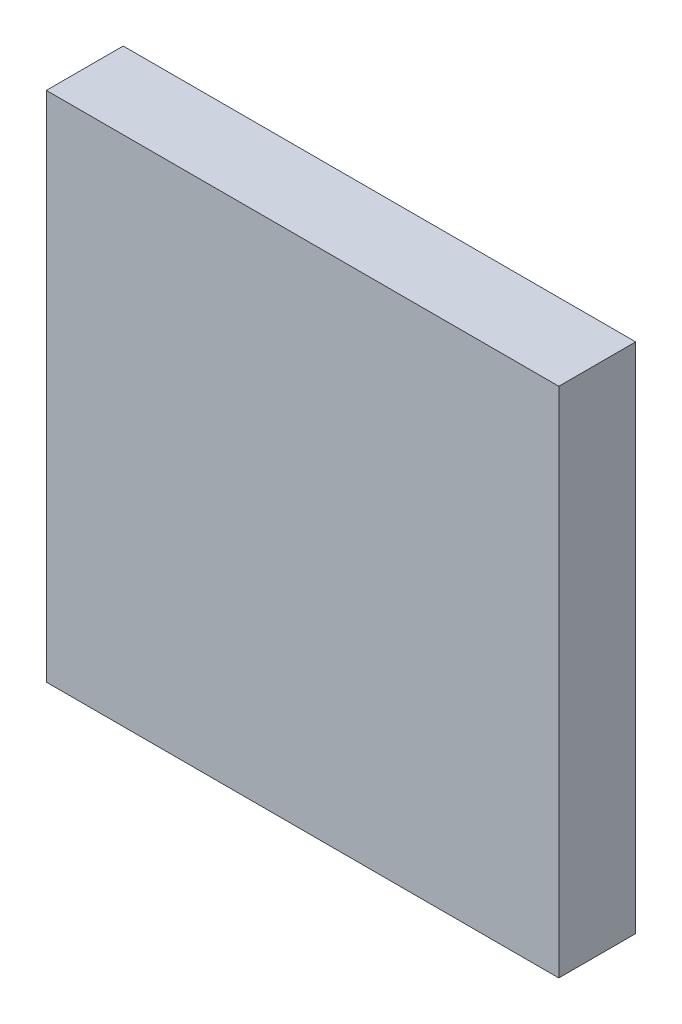
ISO-10303-21;
HEADER;
FILE_DESCRIPTION(('STEP AP214'),'2;1');
FILE_NAME('part.step','',(''),(''),'','','');
FILE_SCHEMA(('AUTOMOTIVE_DESIGN { 1 0 10303 214 1 1 1 1 }'));
ENDSEC;
DATA;
#1=APPLICATION_CONTEXT('core data for automotive mechanical design processes');
#2=APPLICATION_PROTOCOL_DEFINITION('international standard','automotive_design',2000,#1);
#3=PRODUCT_CONTEXT('',#1,'mechanical');
#4=PRODUCT('Part','Part','',(#3));
#5=PRODUCT_RELATED_PRODUCT_CATEGORY('part','',(#4));
#6=PRODUCT_DEFINITION_FORMATION('','',#4);
#7=PRODUCT_DEFINITION_CONTEXT('part definition',#1,'design');
#8=PRODUCT_DEFINITION('design','',#6,#7);
#9=PRODUCT_DEFINITION_SHAPE('','',#8);
#10=(LENGTH_UNIT() NAMED_UNIT(*) SI_UNIT(.MILLI.,.METRE.));
#11=(NAMED_UNIT(*) PLANE_ANGLE_UNIT() SI_UNIT($,.RADIAN.));
#12=(NAMED_UNIT(*) SI_UNIT($,.STERADIAN.) SOLID_ANGLE_UNIT());
#13=UNCERTAINTY_MEASURE_WITH_UNIT(LENGTH_MEASURE(1.E-05),#10,'distance_accuracy_value','');
#14=(GEOMETRIC_REPRESENTATION_CONTEXT(3) GLOBAL_UNCERTAINTY_ASSIGNED_CONTEXT((#13)) GLOBAL_UNIT_ASSIGNED_CONTEXT((#10,
#11,#12)) REPRESENTATION_CONTEXT('',''));
#15=CARTESIAN_POINT('',(0.,0.,0.));
#16=DIRECTION('',(0.,0.,1.));
#17=DIRECTION('',(1.,0.,0.));
#18=AXIS2_PLACEMENT_3D('',#15,#16,#17);
#19=CARTESIAN_POINT('',(0.,0.,30.));
#20=DIRECTION('',(0.,0.,-1.));
#21=DIRECTION('',(-1.,0.,0.));
#22=AXIS2_PLACEMENT_3D('',#19,#20,#21);
#23=PLANE('',#22);
#24=DIRECTION('',(0.,-1.,0.));
#25=VECTOR('',#24,1.);
#26=CARTESIAN_POINT('',(0.,0.,30.));
#27=LINE('',#26,#25);
#28=CARTESIAN_POINT('',(0.,200.,30.));
#29=VERTEX_POINT('',#28);
#30=CARTESIAN_POINT('',(0.,0.,30.));
#31=VERTEX_POINT('',#30);
#32=EDGE_CURVE('E86',#29,#31,#27,.T.);
#33=ORIENTED_EDGE('',*,*,#32,.T.);
#34=DIRECTION('',(1.,0.,0.));
#35=VECTOR('',#34,1.);
#36=CARTESIAN_POINT('',(0.,0.,30.));
#37=LINE('',#36,#35);
#38=CARTESIAN_POINT('',(200.,0.,30.));
#39=VERTEX_POINT('',#38);
#40=EDGE_CURVE('E82',#31,#39,#37,.T.);
#41=ORIENTED_EDGE('',*,*,#40,.T.);
#42=DIRECTION('',(0.,1.,0.));
#43=VECTOR('',#42,1.);
#44=CARTESIAN_POINT('',(200.,0.,30.));
#45=LINE('',#44,#43);
#46=CARTESIAN_POINT('',(200.,200.,30.));
#47=VERTEX_POINT('',#46);
#48=EDGE_CURVE('E84',#39,#47,#45,.T.);
#49=ORIENTED_EDGE('',*,*,#48,.T.);
#50=DIRECTION('',(-1.,0.,0.));
#51=VECTOR('',#50,1.);
#52=CARTESIAN_POINT('',(0.,200.,30.));
#53=LINE('',#52,#51);
#54=EDGE_CURVE('E51',#47,#29,#53,.T.);
#55=ORIENTED_EDGE('',*,*,#54,.T.);
#56=EDGE_LOOP('',(#33,#41,#49,#55));
#57=FACE_BOUND('',#56,.T.);
#58=ADVANCED_FACE('F34',(#57),#23,.F.);
#59=CARTESIAN_POINT('',(0.,0.,0.));
#60=DIRECTION('',(0.,0.,-1.));
#61=DIRECTION('',(-1.,0.,0.));
#62=AXIS2_PLACEMENT_3D('',#59,#60,#61);
#63=PLANE('',#62);
#64=CARTESIAN_POINT('',(145.,130.,0.));
#65=DIRECTION('',(0.,0.,1.));
#66=DIRECTION('',(1.,0.,0.));
#67=AXIS2_PLACEMENT_3D('',#64,#65,#66);
#68=CIRCLE('',#67,10.);
#69=CARTESIAN_POINT('',(155.,130.,0.));
#70=VERTEX_POINT('',#69);
#71=EDGE_CURVE('E104',#70,#70,#68,.T.);
#72=ORIENTED_EDGE('',*,*,#71,.T.);
#73=EDGE_LOOP('',(#72));
#74=FACE_BOUND('',#73,.T.);
#75=DIRECTION('',(0.,-1.,0.));
#76=VECTOR('',#75,1.);
#77=CARTESIAN_POINT('',(0.,0.,0.));
#78=LINE('',#77,#76);
#79=CARTESIAN_POINT('',(0.,200.,0.));
#80=VERTEX_POINT('',#79);
#81=CARTESIAN_POINT('',(0.,0.,0.));
#82=VERTEX_POINT('',#81);
#83=EDGE_CURVE('E101',#80,#82,#78,.T.);
#84=ORIENTED_EDGE('',*,*,#83,.F.);
#85=DIRECTION('',(-1.,0.,0.));
#86=VECTOR('',#85,1.);
#87=CARTESIAN_POINT('',(0.,200.,0.));
#88=LINE('',#87,#86);
#89=CARTESIAN_POINT('',(200.,200.,0.));
#90=VERTEX_POINT('',#89);
#91=EDGE_CURVE('E74',#90,#80,#88,.T.);
#92=ORIENTED_EDGE('',*,*,#91,.F.);
#93=DIRECTION('',(0.,1.,0.));
#94=VECTOR('',#93,1.);
#95=CARTESIAN_POINT('',(200.,0.,0.));
#96=LINE('',#95,#94);
#97=CARTESIAN_POINT('',(200.,0.,0.));
#98=VERTEX_POINT('',#97);
#99=EDGE_CURVE('E68',#98,#90,#96,.T.);
#100=ORIENTED_EDGE('',*,*,#99,.F.);
#101=DIRECTION('',(1.,0.,0.));
#102=VECTOR('',#101,1.);
#103=CARTESIAN_POINT('',(0.,0.,0.));
#104=LINE('',#103,#102);
#105=EDGE_CURVE('E91',#82,#98,#104,.T.);
#106=ORIENTED_EDGE('',*,*,#105,.F.);
#107=EDGE_LOOP('',(#84,#92,#100,#106));
#108=FACE_BOUND('',#107,.T.);
#109=CARTESIAN_POINT('',(55.,130.,0.));
#110=DIRECTION('',(0.,0.,1.));
#111=DIRECTION('',(-1.,0.,0.));
#112=AXIS2_PLACEMENT_3D('',#109,#110,#111);
#113=CIRCLE('',#112,10.);
#114=CARTESIAN_POINT('',(45.,130.,0.));
#115=VERTEX_POINT('',#114);
#116=EDGE_CURVE('E124',#115,#115,#113,.T.);
#117=ORIENTED_EDGE('',*,*,#116,.T.);
#118=EDGE_LOOP('',(#117));
#119=FACE_BOUND('',#118,.T.);
#120=ADVANCED_FACE('F130',(#74,#108,#119),#63,.T.);
#121=CARTESIAN_POINT('',(0.,0.,30.));
#122=DIRECTION('',(1.,0.,0.));
#123=DIRECTION('',(0.,0.,-1.));
#124=AXIS2_PLACEMENT_3D('',#121,#122,#123);
#125=PLANE('',#124);
#126=ORIENTED_EDGE('',*,*,#83,.T.);
#127=DIRECTION('',(0.,0.,-1.));
#128=VECTOR('',#127,1.);
#129=CARTESIAN_POINT('',(0.,0.,30.));
#130=LINE('',#129,#128);
#131=EDGE_CURVE('E92',#31,#82,#130,.T.);
#132=ORIENTED_EDGE('',*,*,#131,.F.);
#133=ORIENTED_EDGE('',*,*,#32,.F.);
#134=DIRECTION('',(0.,0.,-1.));
#135=VECTOR('',#134,1.);
#136=CARTESIAN_POINT('',(0.,200.,30.));
#137=LINE('',#136,#135);
#138=EDGE_CURVE('E97',#29,#80,#137,.T.);
#139=ORIENTED_EDGE('',*,*,#138,.T.);
#140=EDGE_LOOP('',(#126,#132,#133,#139));
#141=FACE_BOUND('',#140,.T.);
#142=ADVANCED_FACE('F36',(#141),#125,.F.);
#143=CARTESIAN_POINT('',(0.,0.,30.));
#144=DIRECTION('',(0.,1.,0.));
#145=DIRECTION('',(0.,0.,1.));
#146=AXIS2_PLACEMENT_3D('',#143,#144,#145);
#147=PLANE('',#146);
#148=ORIENTED_EDGE('',*,*,#105,.T.);
#149=DIRECTION('',(0.,0.,-1.));
#150=VECTOR('',#149,1.);
#151=CARTESIAN_POINT('',(200.,0.,30.));
#152=LINE('',#151,#150);
#153=EDGE_CURVE('E89',#39,#98,#152,.T.);
#154=ORIENTED_EDGE('',*,*,#153,.F.);
#155=ORIENTED_EDGE('',*,*,#40,.F.);
#156=ORIENTED_EDGE('',*,*,#131,.T.);
#157=EDGE_LOOP('',(#148,#154,#155,#156));
#158=FACE_BOUND('',#157,.T.);
#159=ADVANCED_FACE('F90',(#158),#147,.F.);
#160=CARTESIAN_POINT('',(200.,0.,30.));
#161=DIRECTION('',(-1.,0.,0.));
#162=DIRECTION('',(0.,0.,1.));
#163=AXIS2_PLACEMENT_3D('',#160,#161,#162);
#164=PLANE('',#163);
#165=ORIENTED_EDGE('',*,*,#99,.T.);
#166=DIRECTION('',(0.,0.,-1.));
#167=VECTOR('',#166,1.);
#168=CARTESIAN_POINT('',(200.,200.,30.));
#169=LINE('',#168,#167);
#170=EDGE_CURVE('E93',#47,#90,#169,.T.);
#171=ORIENTED_EDGE('',*,*,#170,.F.);
#172=ORIENTED_EDGE('',*,*,#48,.F.);
#173=ORIENTED_EDGE('',*,*,#153,.T.);
#174=EDGE_LOOP('',(#165,#171,#172,#173));
#175=FACE_BOUND('',#174,.T.);
#176=ADVANCED_FACE('F95',(#175),#164,.F.);
#177=CARTESIAN_POINT('',(0.,200.,30.));
#178=DIRECTION('',(0.,-1.,0.));
#179=DIRECTION('',(0.,0.,-1.));
#180=AXIS2_PLACEMENT_3D('',#177,#178,#179);
#181=PLANE('',#180);
#182=ORIENTED_EDGE('',*,*,#91,.T.);
#183=ORIENTED_EDGE('',*,*,#138,.F.);
#184=ORIENTED_EDGE('',*,*,#54,.F.);
#185=ORIENTED_EDGE('',*,*,#170,.T.);
#186=EDGE_LOOP('',(#182,#183,#184,#185));
#187=FACE_BOUND('',#186,.T.);
#188=ADVANCED_FACE('F119',(#187),#181,.F.);
#189=CARTESIAN_POINT('',(145.,130.,30.));
#190=DIRECTION('',(0.,0.,-1.));
#191=DIRECTION('',(-1.,0.,0.));
#192=AXIS2_PLACEMENT_3D('',#189,#190,#191);
#193=CYLINDRICAL_SURFACE('',#192,10.);
#194=CARTESIAN_POINT('',(145.,130.,10.));
#195=DIRECTION('',(0.,0.,-1.));
#196=DIRECTION('',(-1.,0.,0.));
#197=AXIS2_PLACEMENT_3D('',#194,#195,#196);
#198=CIRCLE('',#197,10.);
#199=CARTESIAN_POINT('',(135.,130.,10.));
#200=VERTEX_POINT('',#199);
#201=EDGE_CURVE('E43',#200,#200,#198,.T.);
#202=ORIENTED_EDGE('',*,*,#201,.F.);
#203=EDGE_LOOP('',(#202));
#204=FACE_BOUND('',#203,.T.);
#205=ORIENTED_EDGE('',*,*,#71,.F.);
#206=EDGE_LOOP('',(#205));
#207=FACE_BOUND('',#206,.T.);
#208=ADVANCED_FACE('F115',(#204,#207),#193,.F.);
#209=CARTESIAN_POINT('',(55.,130.,30.));
#210=DIRECTION('',(0.,0.,-1.));
#211=DIRECTION('',(-1.,0.,0.));
#212=AXIS2_PLACEMENT_3D('',#209,#210,#211);
#213=CYLINDRICAL_SURFACE('',#212,10.);
#214=CARTESIAN_POINT('',(55.,130.,10.));
#215=DIRECTION('',(0.,0.,-1.));
#216=DIRECTION('',(-1.,0.,0.));
#217=AXIS2_PLACEMENT_3D('',#214,#215,#216);
#218=CIRCLE('',#217,10.);
#219=CARTESIAN_POINT('',(45.,130.,10.));
#220=VERTEX_POINT('',#219);
#221=EDGE_CURVE('E11',#220,#220,#218,.T.);
#222=ORIENTED_EDGE('',*,*,#221,.F.);
#223=EDGE_LOOP('',(#222));
#224=FACE_BOUND('',#223,.T.);
#225=ORIENTED_EDGE('',*,*,#116,.F.);
#226=EDGE_LOOP('',(#225));
#227=FACE_BOUND('',#226,.T.);
#228=ADVANCED_FACE('F118',(#224,#227),#213,.F.);
#229=CARTESIAN_POINT('',(145.,130.,10.));
#230=DIRECTION('',(0.,0.,-1.));
#231=DIRECTION('',(-1.,0.,0.));
#232=AXIS2_PLACEMENT_3D('',#229,#230,#231);
#233=PLANE('',#232);
#234=ORIENTED_EDGE('',*,*,#201,.T.);
#235=EDGE_LOOP('',(#234));
#236=FACE_BOUND('',#235,.T.);
#237=ADVANCED_FACE('F113',(#236),#233,.T.);
#238=CARTESIAN_POINT('',(55.,130.,10.));
#239=DIRECTION('',(0.,0.,-1.));
#240=DIRECTION('',(-1.,0.,0.));
#241=AXIS2_PLACEMENT_3D('',#238,#239,#240);
#242=PLANE('',#241);
#243=ORIENTED_EDGE('',*,*,#221,.T.);
#244=EDGE_LOOP('',(#243));
#245=FACE_BOUND('',#244,.T.);
#246=ADVANCED_FACE('F138',(#245),#242,.T.);
#247=CLOSED_SHELL('',(#58,#120,#142,#159,#176,#188,#208,#228,#237,#246));
#248=MANIFOLD_SOLID_BREP('B2',#247);
#249=ADVANCED_BREP_SHAPE_REPRESENTATION('',(#18,#248),#14);
#250=SHAPE_DEFINITION_REPRESENTATION(#9,#249);
ENDSEC;
END-ISO-10303-21;
